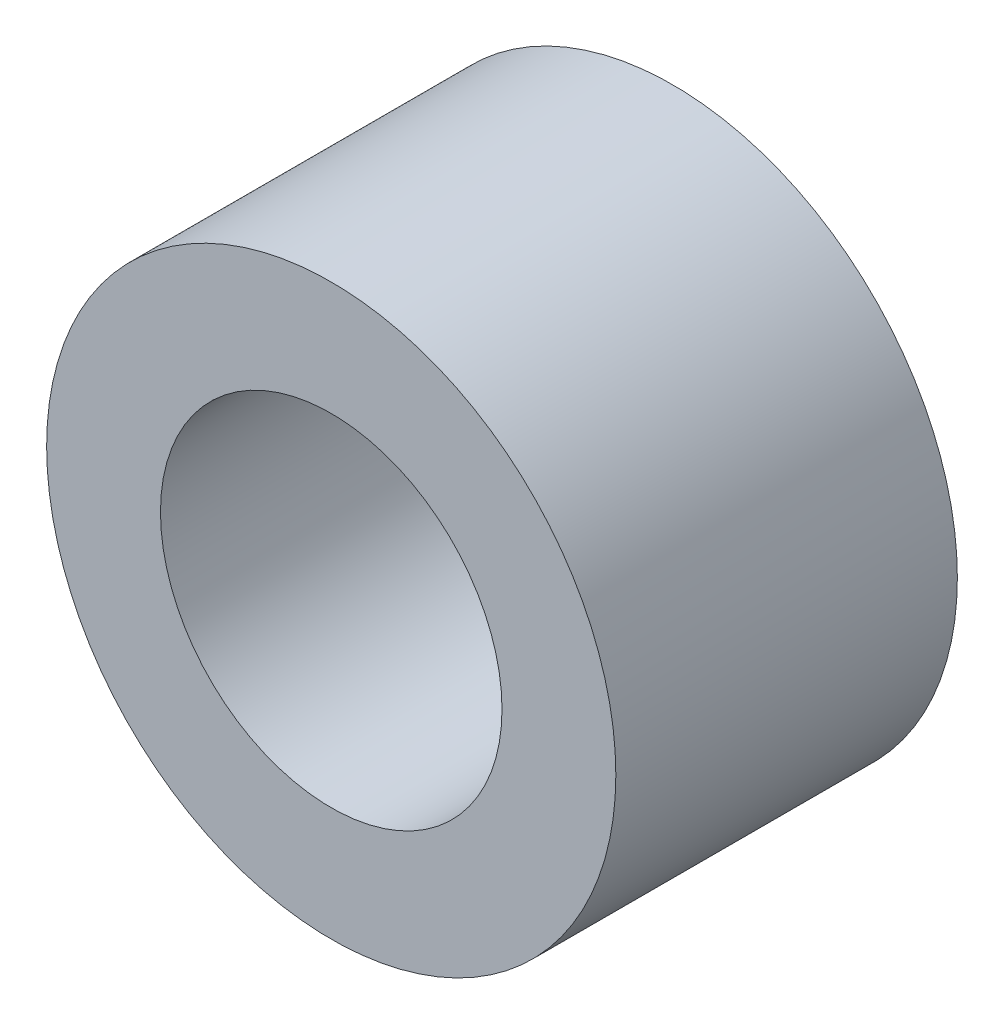
ISO-10303-21;
HEADER;
FILE_DESCRIPTION(('STEP AP214'),'2;1');
FILE_NAME('part.step','',(''),(''),'','','');
FILE_SCHEMA(('AUTOMOTIVE_DESIGN { 1 0 10303 214 1 1 1 1 }'));
ENDSEC;
DATA;
#1=APPLICATION_CONTEXT('core data for automotive mechanical design processes');
#2=APPLICATION_PROTOCOL_DEFINITION('international standard','automotive_design',2000,#1);
#3=PRODUCT_CONTEXT('',#1,'mechanical');
#4=PRODUCT('Part','Part','',(#3));
#5=PRODUCT_RELATED_PRODUCT_CATEGORY('part','',(#4));
#6=PRODUCT_DEFINITION_FORMATION('','',#4);
#7=PRODUCT_DEFINITION_CONTEXT('part definition',#1,'design');
#8=PRODUCT_DEFINITION('design','',#6,#7);
#9=PRODUCT_DEFINITION_SHAPE('','',#8);
#10=(LENGTH_UNIT() NAMED_UNIT(*) SI_UNIT(.MILLI.,.METRE.));
#11=(NAMED_UNIT(*) PLANE_ANGLE_UNIT() SI_UNIT($,.RADIAN.));
#12=(NAMED_UNIT(*) SI_UNIT($,.STERADIAN.) SOLID_ANGLE_UNIT());
#13=UNCERTAINTY_MEASURE_WITH_UNIT(LENGTH_MEASURE(1.E-05),#10,'distance_accuracy_value','');
#14=(GEOMETRIC_REPRESENTATION_CONTEXT(3) GLOBAL_UNCERTAINTY_ASSIGNED_CONTEXT((#13)) GLOBAL_UNIT_ASSIGNED_CONTEXT((#10,
#11,#12)) REPRESENTATION_CONTEXT('',''));
#15=CARTESIAN_POINT('',(0.,0.,0.));
#16=DIRECTION('',(0.,0.,1.));
#17=DIRECTION('',(1.,0.,0.));
#18=AXIS2_PLACEMENT_3D('',#15,#16,#17);
#19=CARTESIAN_POINT('',(0.,0.,12.7));
#20=DIRECTION('',(0.,0.,-1.));
#21=DIRECTION('',(-1.,0.,0.));
#22=AXIS2_PLACEMENT_3D('',#19,#20,#21);
#23=CYLINDRICAL_SURFACE('',#22,19.05);
#24=CARTESIAN_POINT('',(0.,0.,38.1));
#25=DIRECTION('',(0.,0.,1.));
#26=DIRECTION('',(1.,0.,0.));
#27=AXIS2_PLACEMENT_3D('',#24,#25,#26);
#28=CIRCLE('',#27,19.05);
#29=CARTESIAN_POINT('',(19.05,0.,38.1));
#30=VERTEX_POINT('',#29);
#31=EDGE_CURVE('E45',#30,#30,#28,.T.);
#32=ORIENTED_EDGE('',*,*,#31,.T.);
#33=EDGE_LOOP('',(#32));
#34=FACE_BOUND('',#33,.T.);
#35=CARTESIAN_POINT('',(0.,0.,7.62));
#36=DIRECTION('',(0.,0.,-1.));
#37=DIRECTION('',(-1.,0.,0.));
#38=AXIS2_PLACEMENT_3D('',#35,#36,#37);
#39=CIRCLE('',#38,19.05);
#40=CARTESIAN_POINT('',(-19.05,0.,7.62));
#41=VERTEX_POINT('',#40);
#42=EDGE_CURVE('E36',#41,#41,#39,.F.);
#43=ORIENTED_EDGE('',*,*,#42,.F.);
#44=EDGE_LOOP('',(#43));
#45=FACE_BOUND('',#44,.T.);
#46=ADVANCED_FACE('F32',(#34,#45),#23,.F.);
#47=CARTESIAN_POINT('',(0.,0.,38.1));
#48=DIRECTION('',(0.,0.,-1.));
#49=DIRECTION('',(-1.,0.,0.));
#50=AXIS2_PLACEMENT_3D('',#47,#48,#49);
#51=CYLINDRICAL_SURFACE('',#50,31.75);
#52=CARTESIAN_POINT('',(0.,0.,38.1));
#53=DIRECTION('',(0.,0.,1.));
#54=DIRECTION('',(1.,0.,0.));
#55=AXIS2_PLACEMENT_3D('',#52,#53,#54);
#56=CIRCLE('',#55,31.75);
#57=CARTESIAN_POINT('',(31.75,0.,38.1));
#58=VERTEX_POINT('',#57);
#59=EDGE_CURVE('E10',#58,#58,#56,.T.);
#60=ORIENTED_EDGE('',*,*,#59,.F.);
#61=EDGE_LOOP('',(#60));
#62=FACE_BOUND('',#61,.T.);
#63=CARTESIAN_POINT('',(0.,0.,0.));
#64=DIRECTION('',(0.,0.,1.));
#65=DIRECTION('',(1.,0.,0.));
#66=AXIS2_PLACEMENT_3D('',#63,#64,#65);
#67=CIRCLE('',#66,31.75);
#68=CARTESIAN_POINT('',(31.75,0.,0.));
#69=VERTEX_POINT('',#68);
#70=EDGE_CURVE('E40',#69,#69,#67,.T.);
#71=ORIENTED_EDGE('',*,*,#70,.T.);
#72=EDGE_LOOP('',(#71));
#73=FACE_BOUND('',#72,.T.);
#74=ADVANCED_FACE('F34',(#62,#73),#51,.T.);
#75=CARTESIAN_POINT('',(0.,0.,38.1));
#76=DIRECTION('',(0.,0.,1.));
#77=DIRECTION('',(1.,0.,0.));
#78=AXIS2_PLACEMENT_3D('',#75,#76,#77);
#79=PLANE('',#78);
#80=ORIENTED_EDGE('',*,*,#31,.F.);
#81=EDGE_LOOP('',(#80));
#82=FACE_BOUND('',#81,.T.);
#83=ORIENTED_EDGE('',*,*,#59,.T.);
#84=EDGE_LOOP('',(#83));
#85=FACE_BOUND('',#84,.T.);
#86=ADVANCED_FACE('F67',(#82,#85),#79,.T.);
#87=CARTESIAN_POINT('',(0.,0.,0.));
#88=DIRECTION('',(0.,0.,1.));
#89=DIRECTION('',(1.,0.,0.));
#90=AXIS2_PLACEMENT_3D('',#87,#88,#89);
#91=PLANE('',#90);
#92=CARTESIAN_POINT('',(0.,0.,0.));
#93=DIRECTION('',(0.,0.,-1.));
#94=DIRECTION('',(-1.,0.,0.));
#95=AXIS2_PLACEMENT_3D('',#92,#93,#94);
#96=CIRCLE('',#95,22.86);
#97=CARTESIAN_POINT('',(-22.86,0.,0.));
#98=VERTEX_POINT('',#97);
#99=EDGE_CURVE('E49',#98,#98,#96,.T.);
#100=ORIENTED_EDGE('',*,*,#99,.F.);
#101=EDGE_LOOP('',(#100));
#102=FACE_BOUND('',#101,.T.);
#103=ORIENTED_EDGE('',*,*,#70,.F.);
#104=EDGE_LOOP('',(#103));
#105=FACE_BOUND('',#104,.T.);
#106=ADVANCED_FACE('F74',(#102,#105),#91,.F.);
#107=CARTESIAN_POINT('',(0.,0.,7.62));
#108=DIRECTION('',(0.,0.,-1.));
#109=DIRECTION('',(-1.,0.,0.));
#110=AXIS2_PLACEMENT_3D('',#107,#108,#109);
#111=PLANE('',#110);
#112=CARTESIAN_POINT('',(0.,0.,7.62));
#113=DIRECTION('',(0.,0.,-1.));
#114=DIRECTION('',(-1.,0.,0.));
#115=AXIS2_PLACEMENT_3D('',#112,#113,#114);
#116=CIRCLE('',#115,22.86);
#117=CARTESIAN_POINT('',(-22.86,0.,7.62));
#118=VERTEX_POINT('',#117);
#119=EDGE_CURVE('E52',#118,#118,#116,.T.);
#120=ORIENTED_EDGE('',*,*,#119,.T.);
#121=EDGE_LOOP('',(#120));
#122=FACE_BOUND('',#121,.T.);
#123=ORIENTED_EDGE('',*,*,#42,.T.);
#124=EDGE_LOOP('',(#123));
#125=FACE_BOUND('',#124,.T.);
#126=ADVANCED_FACE('F59',(#122,#125),#111,.T.);
#127=CARTESIAN_POINT('',(0.,0.,7.62));
#128=DIRECTION('',(0.,0.,-1.));
#129=DIRECTION('',(-1.,0.,0.));
#130=AXIS2_PLACEMENT_3D('',#127,#128,#129);
#131=CYLINDRICAL_SURFACE('',#130,22.86);
#132=ORIENTED_EDGE('',*,*,#119,.F.);
#133=EDGE_LOOP('',(#132));
#134=FACE_BOUND('',#133,.T.);
#135=ORIENTED_EDGE('',*,*,#99,.T.);
#136=EDGE_LOOP('',(#135));
#137=FACE_BOUND('',#136,.T.);
#138=ADVANCED_FACE('F71',(#134,#137),#131,.F.);
#139=CLOSED_SHELL('',(#46,#74,#86,#106,#126,#138));
#140=MANIFOLD_SOLID_BREP('B2',#139);
#141=ADVANCED_BREP_SHAPE_REPRESENTATION('',(#18,#140),#14);
#142=SHAPE_DEFINITION_REPRESENTATION(#9,#141);
ENDSEC;
END-ISO-10303-21;
